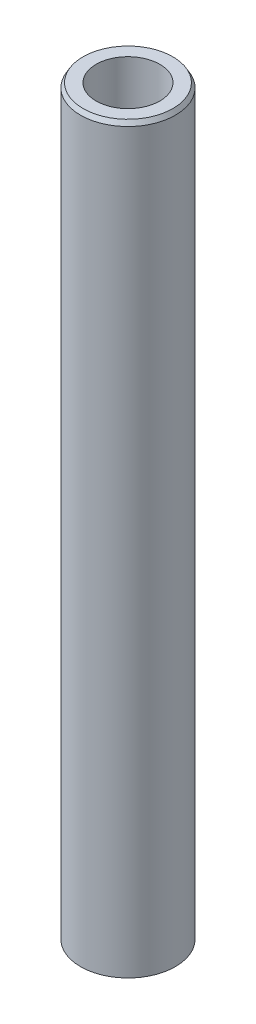
ISO-10303-21;
HEADER;
FILE_DESCRIPTION(('STEP AP214'),'2;1');
FILE_NAME('part.step','',(''),(''),'','','');
FILE_SCHEMA(('AUTOMOTIVE_DESIGN { 1 0 10303 214 1 1 1 1 }'));
ENDSEC;
DATA;
#1=APPLICATION_CONTEXT('core data for automotive mechanical design processes');
#2=APPLICATION_PROTOCOL_DEFINITION('international standard','automotive_design',2000,#1);
#3=PRODUCT_CONTEXT('',#1,'mechanical');
#4=PRODUCT('Part','Part','',(#3));
#5=PRODUCT_RELATED_PRODUCT_CATEGORY('part','',(#4));
#6=PRODUCT_DEFINITION_FORMATION('','',#4);
#7=PRODUCT_DEFINITION_CONTEXT('part definition',#1,'design');
#8=PRODUCT_DEFINITION('design','',#6,#7);
#9=PRODUCT_DEFINITION_SHAPE('','',#8);
#10=(LENGTH_UNIT() NAMED_UNIT(*) SI_UNIT(.MILLI.,.METRE.));
#11=(NAMED_UNIT(*) PLANE_ANGLE_UNIT() SI_UNIT($,.RADIAN.));
#12=(NAMED_UNIT(*) SI_UNIT($,.STERADIAN.) SOLID_ANGLE_UNIT());
#13=UNCERTAINTY_MEASURE_WITH_UNIT(LENGTH_MEASURE(1.E-05),#10,'distance_accuracy_value','');
#14=(GEOMETRIC_REPRESENTATION_CONTEXT(3) GLOBAL_UNCERTAINTY_ASSIGNED_CONTEXT((#13)) GLOBAL_UNIT_ASSIGNED_CONTEXT((#10,
#11,#12)) REPRESENTATION_CONTEXT('',''));
#15=CARTESIAN_POINT('',(0.,0.,0.));
#16=DIRECTION('',(0.,0.,1.));
#17=DIRECTION('',(1.,0.,0.));
#18=AXIS2_PLACEMENT_3D('',#15,#16,#17);
#19=CARTESIAN_POINT('',(0.,196.030144604557,0.));
#20=DIRECTION('',(0.,-1.,0.));
#21=DIRECTION('',(0.,0.,-1.));
#22=AXIS2_PLACEMENT_3D('',#19,#20,#21);
#23=CYLINDRICAL_SURFACE('',#22,12.5);
#24=CARTESIAN_POINT('',(0.,194.854824378056,0.));
#25=DIRECTION('',(0.,1.,0.));
#26=DIRECTION('',(0.,0.,1.));
#27=AXIS2_PLACEMENT_3D('',#24,#25,#26);
#28=CIRCLE('',#27,12.5);
#29=CARTESIAN_POINT('',(0.,194.854824378056,12.5));
#30=VERTEX_POINT('',#29);
#31=EDGE_CURVE('E50',#30,#30,#28,.F.);
#32=ORIENTED_EDGE('',*,*,#31,.T.);
#33=EDGE_LOOP('',(#32));
#34=FACE_BOUND('',#33,.T.);
#35=CARTESIAN_POINT('',(0.,0.678571449153842,0.));
#36=DIRECTION('',(0.,1.,0.));
#37=DIRECTION('',(0.,0.,1.));
#38=AXIS2_PLACEMENT_3D('',#35,#36,#37);
#39=CIRCLE('',#38,12.5);
#40=CARTESIAN_POINT('',(0.,0.678571449153842,12.5));
#41=VERTEX_POINT('',#40);
#42=EDGE_CURVE('E51',#41,#41,#39,.T.);
#43=ORIENTED_EDGE('',*,*,#42,.T.);
#44=EDGE_LOOP('',(#43));
#45=FACE_BOUND('',#44,.T.);
#46=ADVANCED_FACE('F39',(#34,#45),#23,.T.);
#47=CARTESIAN_POINT('',(0.,196.030144604557,0.));
#48=DIRECTION('',(0.,1.,0.));
#49=DIRECTION('',(0.,0.,1.));
#50=AXIS2_PLACEMENT_3D('',#47,#48,#49);
#51=PLANE('',#50);
#52=CARTESIAN_POINT('',(0.,196.030144604557,0.));
#53=DIRECTION('',(0.,1.,0.));
#54=DIRECTION('',(0.,0.,1.));
#55=AXIS2_PLACEMENT_3D('',#52,#53,#54);
#56=CIRCLE('',#55,11.8214285508461);
#57=CARTESIAN_POINT('',(0.,196.030144604557,11.8214285508461));
#58=VERTEX_POINT('',#57);
#59=EDGE_CURVE('E54',#58,#58,#56,.T.);
#60=ORIENTED_EDGE('',*,*,#59,.T.);
#61=EDGE_LOOP('',(#60));
#62=FACE_BOUND('',#61,.T.);
#63=CARTESIAN_POINT('',(0.,196.030144604557,0.));
#64=DIRECTION('',(0.,1.,0.));
#65=DIRECTION('',(0.,0.,1.));
#66=AXIS2_PLACEMENT_3D('',#63,#64,#65);
#67=CIRCLE('',#66,8.38730179165497);
#68=CARTESIAN_POINT('',(0.,196.030144604557,8.38730179165497));
#69=VERTEX_POINT('',#68);
#70=EDGE_CURVE('E58',#69,#69,#67,.T.);
#71=ORIENTED_EDGE('',*,*,#70,.F.);
#72=EDGE_LOOP('',(#71));
#73=FACE_BOUND('',#72,.T.);
#74=ADVANCED_FACE('F69',(#62,#73),#51,.T.);
#75=CARTESIAN_POINT('',(0.,0.,0.));
#76=DIRECTION('',(0.,1.,0.));
#77=DIRECTION('',(0.,0.,1.));
#78=AXIS2_PLACEMENT_3D('',#75,#76,#77);
#79=PLANE('',#78);
#80=CARTESIAN_POINT('',(0.,0.,0.));
#81=DIRECTION('',(0.,1.,0.));
#82=DIRECTION('',(0.,0.,1.));
#83=AXIS2_PLACEMENT_3D('',#80,#81,#82);
#84=CIRCLE('',#83,11.3246797734999);
#85=CARTESIAN_POINT('',(0.,0.,11.3246797734999));
#86=VERTEX_POINT('',#85);
#87=EDGE_CURVE('E10',#86,#86,#84,.F.);
#88=ORIENTED_EDGE('',*,*,#87,.T.);
#89=EDGE_LOOP('',(#88));
#90=FACE_BOUND('',#89,.T.);
#91=CARTESIAN_POINT('',(0.,0.,0.));
#92=DIRECTION('',(0.,1.,0.));
#93=DIRECTION('',(0.,0.,1.));
#94=AXIS2_PLACEMENT_3D('',#91,#92,#93);
#95=CIRCLE('',#94,8.38730179165497);
#96=CARTESIAN_POINT('',(0.,0.,8.38730179165497));
#97=VERTEX_POINT('',#96);
#98=EDGE_CURVE('E63',#97,#97,#95,.T.);
#99=ORIENTED_EDGE('',*,*,#98,.T.);
#100=EDGE_LOOP('',(#99));
#101=FACE_BOUND('',#100,.T.);
#102=ADVANCED_FACE('F75',(#90,#101),#79,.F.);
#103=CARTESIAN_POINT('',(0.,196.030144604557,0.));
#104=DIRECTION('',(0.,-1.,0.));
#105=DIRECTION('',(0.,0.,-1.));
#106=AXIS2_PLACEMENT_3D('',#103,#104,#105);
#107=CYLINDRICAL_SURFACE('',#106,8.38730179165497);
#108=ORIENTED_EDGE('',*,*,#70,.T.);
#109=EDGE_LOOP('',(#108));
#110=FACE_BOUND('',#109,.T.);
#111=ORIENTED_EDGE('',*,*,#98,.F.);
#112=EDGE_LOOP('',(#111));
#113=FACE_BOUND('',#112,.T.);
#114=ADVANCED_FACE('F70',(#110,#113),#107,.F.);
#115=CARTESIAN_POINT('',(0.,196.030144604557,0.));
#116=DIRECTION('',(0.,-1.,0.));
#117=DIRECTION('',(0.,0.,-1.));
#118=AXIS2_PLACEMENT_3D('',#115,#116,#117);
#119=CONICAL_SURFACE('',#118,11.8214285508461,0.523598775598295);
#120=ORIENTED_EDGE('',*,*,#31,.F.);
#121=EDGE_LOOP('',(#120));
#122=FACE_BOUND('',#121,.T.);
#123=ORIENTED_EDGE('',*,*,#59,.F.);
#124=EDGE_LOOP('',(#123));
#125=FACE_BOUND('',#124,.T.);
#126=ADVANCED_FACE('F81',(#122,#125),#119,.T.);
#127=CARTESIAN_POINT('',(0.,0.678571449153842,0.));
#128=DIRECTION('',(0.,1.,0.));
#129=DIRECTION('',(0.,0.,1.));
#130=AXIS2_PLACEMENT_3D('',#127,#128,#129);
#131=CONICAL_SURFACE('',#130,12.5,1.0471975511966);
#132=ORIENTED_EDGE('',*,*,#87,.F.);
#133=EDGE_LOOP('',(#132));
#134=FACE_BOUND('',#133,.T.);
#135=ORIENTED_EDGE('',*,*,#42,.F.);
#136=EDGE_LOOP('',(#135));
#137=FACE_BOUND('',#136,.T.);
#138=ADVANCED_FACE('F45',(#134,#137),#131,.T.);
#139=CLOSED_SHELL('',(#46,#74,#102,#114,#126,#138));
#140=MANIFOLD_SOLID_BREP('B2',#139);
#141=ADVANCED_BREP_SHAPE_REPRESENTATION('',(#18,#140),#14);
#142=SHAPE_DEFINITION_REPRESENTATION(#9,#141);
ENDSEC;
END-ISO-10303-21;
